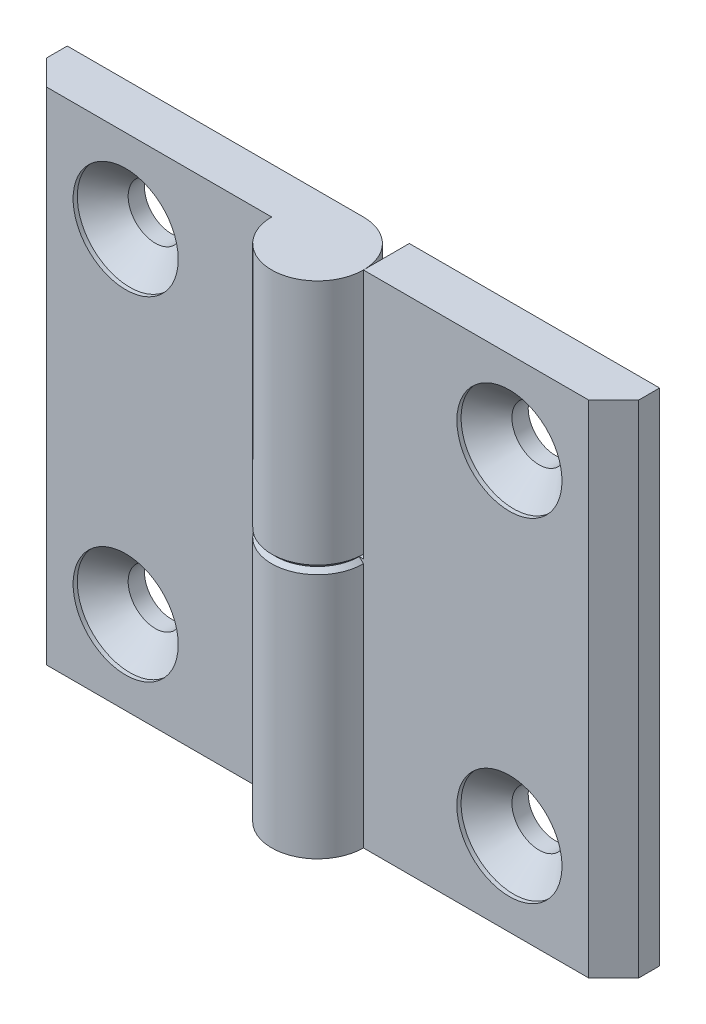
ISO-10303-21;
HEADER;
FILE_DESCRIPTION(('STEP AP214'),'2;1');
FILE_NAME('part.step','',(''),(''),'','','');
FILE_SCHEMA(('AUTOMOTIVE_DESIGN { 1 0 10303 214 1 1 1 1 }'));
ENDSEC;
DATA;
#1=APPLICATION_CONTEXT('core data for automotive mechanical design processes');
#2=APPLICATION_PROTOCOL_DEFINITION('international standard','automotive_design',2000,#1);
#3=PRODUCT_CONTEXT('',#1,'mechanical');
#4=PRODUCT('Part','Part','',(#3));
#5=PRODUCT_RELATED_PRODUCT_CATEGORY('part','',(#4));
#6=PRODUCT_DEFINITION_FORMATION('','',#4);
#7=PRODUCT_DEFINITION_CONTEXT('part definition',#1,'design');
#8=PRODUCT_DEFINITION('design','',#6,#7);
#9=PRODUCT_DEFINITION_SHAPE('','',#8);
#10=(LENGTH_UNIT() NAMED_UNIT(*) SI_UNIT(.MILLI.,.METRE.));
#11=(NAMED_UNIT(*) PLANE_ANGLE_UNIT() SI_UNIT($,.RADIAN.));
#12=(NAMED_UNIT(*) SI_UNIT($,.STERADIAN.) SOLID_ANGLE_UNIT());
#13=UNCERTAINTY_MEASURE_WITH_UNIT(LENGTH_MEASURE(1.E-05),#10,'distance_accuracy_value','');
#14=(GEOMETRIC_REPRESENTATION_CONTEXT(3) GLOBAL_UNCERTAINTY_ASSIGNED_CONTEXT((#13)) GLOBAL_UNIT_ASSIGNED_CONTEXT((#10,
#11,#12)) REPRESENTATION_CONTEXT('',''));
#15=CARTESIAN_POINT('',(0.,0.,0.));
#16=DIRECTION('',(0.,0.,1.));
#17=DIRECTION('',(1.,0.,0.));
#18=AXIS2_PLACEMENT_3D('',#15,#16,#17);
#19=CARTESIAN_POINT('',(0.,-30.,0.));
#20=DIRECTION('',(0.,1.,0.));
#21=DIRECTION('',(0.,0.,-1.));
#22=AXIS2_PLACEMENT_3D('',#19,#20,#21);
#23=CYLINDRICAL_SURFACE('',#22,5.5);
#24=DIRECTION('',(0.,1.,0.));
#25=VECTOR('',#24,1.);
#26=CARTESIAN_POINT('',(5.5,-30.,0.));
#27=LINE('',#26,#25);
#28=CARTESIAN_POINT('',(5.5,-30.,0.));
#29=VERTEX_POINT('',#28);
#30=CARTESIAN_POINT('',(5.5,-0.499999999999997,0.));
#31=VERTEX_POINT('',#30);
#32=EDGE_CURVE('E157',#29,#31,#27,.T.);
#33=ORIENTED_EDGE('',*,*,#32,.T.);
#34=CARTESIAN_POINT('',(0.,-0.499999999999997,0.));
#35=DIRECTION('',(0.,-1.,0.));
#36=DIRECTION('',(0.,0.,1.));
#37=AXIS2_PLACEMENT_3D('',#34,#35,#36);
#38=CIRCLE('',#37,5.5);
#39=CARTESIAN_POINT('',(0.,-0.499999999999997,-5.5));
#40=VERTEX_POINT('',#39);
#41=EDGE_CURVE('E175',#31,#40,#38,.T.);
#42=ORIENTED_EDGE('',*,*,#41,.T.);
#43=DIRECTION('',(0.,1.,0.));
#44=VECTOR('',#43,1.);
#45=CARTESIAN_POINT('',(0.,-30.,-5.5));
#46=LINE('',#45,#44);
#47=CARTESIAN_POINT('',(0.,-30.,-5.5));
#48=VERTEX_POINT('',#47);
#49=EDGE_CURVE('E167',#48,#40,#46,.T.);
#50=ORIENTED_EDGE('',*,*,#49,.F.);
#51=CARTESIAN_POINT('',(0.,-30.,0.));
#52=DIRECTION('',(0.,-1.,0.));
#53=DIRECTION('',(0.,0.,1.));
#54=AXIS2_PLACEMENT_3D('',#51,#52,#53);
#55=CIRCLE('',#54,5.5);
#56=EDGE_CURVE('E156',#29,#48,#55,.T.);
#57=ORIENTED_EDGE('',*,*,#56,.F.);
#58=EDGE_LOOP('',(#33,#42,#50,#57));
#59=FACE_BOUND('',#58,.T.);
#60=ADVANCED_FACE('F46',(#59),#23,.T.);
#61=CARTESIAN_POINT('',(0.,-30.,-5.5));
#62=DIRECTION('',(0.,0.,1.));
#63=DIRECTION('',(-1.,0.,0.));
#64=AXIS2_PLACEMENT_3D('',#61,#62,#63);
#65=PLANE('',#64);
#66=CARTESIAN_POINT('',(23.,-20.,-5.50000000000017));
#67=DIRECTION('',(0.,0.,1.));
#68=DIRECTION('',(-1.,0.,0.));
#69=AXIS2_PLACEMENT_3D('',#66,#67,#68);
#70=CIRCLE('',#69,3.25);
#71=CARTESIAN_POINT('',(19.75,-20.,-5.50000000000015));
#72=VERTEX_POINT('',#71);
#73=EDGE_CURVE('E197',#72,#72,#70,.T.);
#74=ORIENTED_EDGE('',*,*,#73,.T.);
#75=EDGE_LOOP('',(#74));
#76=FACE_BOUND('',#75,.T.);
#77=CARTESIAN_POINT('',(23.,20.,-5.50000000000017));
#78=DIRECTION('',(0.,0.,1.));
#79=DIRECTION('',(-1.,0.,0.));
#80=AXIS2_PLACEMENT_3D('',#77,#78,#79);
#81=CIRCLE('',#80,3.25);
#82=CARTESIAN_POINT('',(19.75,20.,-5.50000000000015));
#83=VERTEX_POINT('',#82);
#84=EDGE_CURVE('E139',#83,#83,#81,.T.);
#85=ORIENTED_EDGE('',*,*,#84,.T.);
#86=EDGE_LOOP('',(#85));
#87=FACE_BOUND('',#86,.T.);
#88=ORIENTED_EDGE('',*,*,#49,.T.);
#89=DIRECTION('',(1.,0.,0.));
#90=VECTOR('',#89,1.);
#91=CARTESIAN_POINT('',(0.,-0.499999999999997,-5.5));
#92=LINE('',#91,#90);
#93=CARTESIAN_POINT('',(5.49999999999996,-0.499999999999997,-5.50000000000004));
#94=VERTEX_POINT('',#93);
#95=EDGE_CURVE('E138',#40,#94,#92,.T.);
#96=ORIENTED_EDGE('',*,*,#95,.T.);
#97=DIRECTION('',(0.,1.,0.));
#98=VECTOR('',#97,1.);
#99=CARTESIAN_POINT('',(5.49999999999996,30.,-5.50000000000004));
#100=LINE('',#99,#98);
#101=CARTESIAN_POINT('',(5.49999999999996,30.,-5.50000000000004));
#102=VERTEX_POINT('',#101);
#103=EDGE_CURVE('E119',#94,#102,#100,.T.);
#104=ORIENTED_EDGE('',*,*,#103,.T.);
#105=DIRECTION('',(1.,0.,0.));
#106=VECTOR('',#105,1.);
#107=CARTESIAN_POINT('',(0.,30.,-5.5));
#108=LINE('',#107,#106);
#109=CARTESIAN_POINT('',(35.5,30.,-5.50000000000026));
#110=VERTEX_POINT('',#109);
#111=EDGE_CURVE('E135',#102,#110,#108,.T.);
#112=ORIENTED_EDGE('',*,*,#111,.T.);
#113=DIRECTION('',(0.,1.,0.));
#114=VECTOR('',#113,1.);
#115=CARTESIAN_POINT('',(35.5,-30.,-5.50000000000026));
#116=LINE('',#115,#114);
#117=CARTESIAN_POINT('',(35.5,-30.,-5.50000000000026));
#118=VERTEX_POINT('',#117);
#119=EDGE_CURVE('E165',#118,#110,#116,.T.);
#120=ORIENTED_EDGE('',*,*,#119,.F.);
#121=DIRECTION('',(1.,0.,0.));
#122=VECTOR('',#121,1.);
#123=CARTESIAN_POINT('',(0.,-30.,-5.5));
#124=LINE('',#123,#122);
#125=EDGE_CURVE('E213',#48,#118,#124,.T.);
#126=ORIENTED_EDGE('',*,*,#125,.F.);
#127=EDGE_LOOP('',(#88,#96,#104,#112,#120,#126));
#128=FACE_BOUND('',#127,.T.);
#129=ADVANCED_FACE('F133',(#76,#87,#128),#65,.F.);
#130=CARTESIAN_POINT('',(35.5,-30.,-5.50000000000026));
#131=DIRECTION('',(-1.,0.,0.));
#132=DIRECTION('',(0.,0.,-1.));
#133=AXIS2_PLACEMENT_3D('',#130,#131,#132);
#134=PLANE('',#133);
#135=DIRECTION('',(0.,0.,1.));
#136=VECTOR('',#135,1.);
#137=CARTESIAN_POINT('',(35.5,30.,-5.50000000000026));
#138=LINE('',#137,#136);
#139=CARTESIAN_POINT('',(35.5,30.,-3.00000000000026));
#140=VERTEX_POINT('',#139);
#141=EDGE_CURVE('E144',#110,#140,#138,.T.);
#142=ORIENTED_EDGE('',*,*,#141,.T.);
#143=DIRECTION('',(0.,1.,0.));
#144=VECTOR('',#143,1.);
#145=CARTESIAN_POINT('',(35.5,-30.,-3.00000000000026));
#146=LINE('',#145,#144);
#147=CARTESIAN_POINT('',(35.5,-30.,-3.00000000000026));
#148=VERTEX_POINT('',#147);
#149=EDGE_CURVE('E162',#148,#140,#146,.T.);
#150=ORIENTED_EDGE('',*,*,#149,.F.);
#151=DIRECTION('',(0.,0.,1.));
#152=VECTOR('',#151,1.);
#153=CARTESIAN_POINT('',(35.5,-30.,-5.50000000000026));
#154=LINE('',#153,#152);
#155=EDGE_CURVE('E215',#118,#148,#154,.T.);
#156=ORIENTED_EDGE('',*,*,#155,.F.);
#157=ORIENTED_EDGE('',*,*,#119,.T.);
#158=EDGE_LOOP('',(#142,#150,#156,#157));
#159=FACE_BOUND('',#158,.T.);
#160=ADVANCED_FACE('F229',(#159),#134,.F.);
#161=CARTESIAN_POINT('',(35.5,-30.,-3.00000000000026));
#162=DIRECTION('',(-0.707106781186549,0.,-0.707106781186546));
#163=DIRECTION('',(0.707106781186546,0.,-0.707106781186549));
#164=AXIS2_PLACEMENT_3D('',#161,#162,#163);
#165=PLANE('',#164);
#166=DIRECTION('',(-0.707106781186545,0.,0.707106781186549));
#167=VECTOR('',#166,1.);
#168=CARTESIAN_POINT('',(35.5,30.,-3.00000000000026));
#169=LINE('',#168,#167);
#170=CARTESIAN_POINT('',(32.5,30.,-2.42866695413719E-13));
#171=VERTEX_POINT('',#170);
#172=EDGE_CURVE('E146',#140,#171,#169,.T.);
#173=ORIENTED_EDGE('',*,*,#172,.T.);
#174=DIRECTION('',(0.,1.,0.));
#175=VECTOR('',#174,1.);
#176=CARTESIAN_POINT('',(32.5,-30.,-2.42866695413719E-13));
#177=LINE('',#176,#175);
#178=CARTESIAN_POINT('',(32.5,-30.,-2.42866695413719E-13));
#179=VERTEX_POINT('',#178);
#180=EDGE_CURVE('E159',#179,#171,#177,.T.);
#181=ORIENTED_EDGE('',*,*,#180,.F.);
#182=DIRECTION('',(-0.707106781186545,0.,0.707106781186549));
#183=VECTOR('',#182,1.);
#184=CARTESIAN_POINT('',(35.5,-30.,-3.00000000000026));
#185=LINE('',#184,#183);
#186=EDGE_CURVE('E216',#148,#179,#185,.T.);
#187=ORIENTED_EDGE('',*,*,#186,.F.);
#188=ORIENTED_EDGE('',*,*,#149,.T.);
#189=EDGE_LOOP('',(#173,#181,#187,#188));
#190=FACE_BOUND('',#189,.T.);
#191=ADVANCED_FACE('F231',(#190),#165,.F.);
#192=CARTESIAN_POINT('',(32.5,-30.,-2.42866695413719E-13));
#193=DIRECTION('',(0.,0.,-1.));
#194=DIRECTION('',(1.,0.,0.));
#195=AXIS2_PLACEMENT_3D('',#192,#193,#194);
#196=PLANE('',#195);
#197=CARTESIAN_POINT('',(23.,-20.,-1.72091732573437E-13));
#198=DIRECTION('',(0.,0.,1.));
#199=DIRECTION('',(-1.,0.,0.));
#200=AXIS2_PLACEMENT_3D('',#197,#198,#199);
#201=CIRCLE('',#200,6.3);
#202=CARTESIAN_POINT('',(16.7,-20.,-1.25012957770162E-13));
#203=VERTEX_POINT('',#202);
#204=EDGE_CURVE('E185',#203,#203,#201,.T.);
#205=ORIENTED_EDGE('',*,*,#204,.F.);
#206=EDGE_LOOP('',(#205));
#207=FACE_BOUND('',#206,.T.);
#208=CARTESIAN_POINT('',(23.,20.,-1.72091732573437E-13));
#209=DIRECTION('',(0.,0.,1.));
#210=DIRECTION('',(-1.,0.,0.));
#211=AXIS2_PLACEMENT_3D('',#208,#209,#210);
#212=CIRCLE('',#211,6.3);
#213=CARTESIAN_POINT('',(16.7,20.,-1.25012957770162E-13));
#214=VERTEX_POINT('',#213);
#215=EDGE_CURVE('E200',#214,#214,#212,.T.);
#216=ORIENTED_EDGE('',*,*,#215,.F.);
#217=EDGE_LOOP('',(#216));
#218=FACE_BOUND('',#217,.T.);
#219=DIRECTION('',(-1.,0.,0.));
#220=VECTOR('',#219,1.);
#221=CARTESIAN_POINT('',(32.5,30.,-2.42866695413719E-13));
#222=LINE('',#221,#220);
#223=CARTESIAN_POINT('',(5.5,30.,0.));
#224=VERTEX_POINT('',#223);
#225=EDGE_CURVE('E154',#171,#224,#222,.T.);
#226=ORIENTED_EDGE('',*,*,#225,.T.);
#227=DIRECTION('',(0.,-1.,0.));
#228=VECTOR('',#227,1.);
#229=CARTESIAN_POINT('',(5.5,-30.,0.));
#230=LINE('',#229,#228);
#231=CARTESIAN_POINT('',(5.5,0.,0.));
#232=VERTEX_POINT('',#231);
#233=EDGE_CURVE('E123',#224,#232,#230,.T.);
#234=ORIENTED_EDGE('',*,*,#233,.T.);
#235=DIRECTION('',(1.,0.,0.));
#236=VECTOR('',#235,1.);
#237=CARTESIAN_POINT('',(-5.5,0.,0.));
#238=LINE('',#237,#236);
#239=CARTESIAN_POINT('',(4.99999999999999,0.,0.));
#240=VERTEX_POINT('',#239);
#241=EDGE_CURVE('E170',#240,#232,#238,.T.);
#242=ORIENTED_EDGE('',*,*,#241,.F.);
#243=DIRECTION('',(0.707106781186555,-0.70710678118654,0.));
#244=VECTOR('',#243,1.);
#245=CARTESIAN_POINT('',(0.,4.99999999999989,0.));
#246=LINE('',#245,#244);
#247=EDGE_CURVE('E12',#240,#31,#246,.T.);
#248=ORIENTED_EDGE('',*,*,#247,.T.);
#249=ORIENTED_EDGE('',*,*,#32,.F.);
#250=DIRECTION('',(-1.,0.,0.));
#251=VECTOR('',#250,1.);
#252=CARTESIAN_POINT('',(32.5,-30.,-2.42866695413719E-13));
#253=LINE('',#252,#251);
#254=EDGE_CURVE('E150',#179,#29,#253,.T.);
#255=ORIENTED_EDGE('',*,*,#254,.F.);
#256=ORIENTED_EDGE('',*,*,#180,.T.);
#257=EDGE_LOOP('',(#226,#234,#242,#248,#249,#255,#256));
#258=FACE_BOUND('',#257,.T.);
#259=ADVANCED_FACE('F224',(#207,#218,#258),#196,.F.);
#260=CARTESIAN_POINT('',(0.,-30.,0.));
#261=DIRECTION('',(0.,-1.,0.));
#262=DIRECTION('',(0.,0.,1.));
#263=AXIS2_PLACEMENT_3D('',#260,#261,#262);
#264=PLANE('',#263);
#265=ORIENTED_EDGE('',*,*,#56,.T.);
#266=ORIENTED_EDGE('',*,*,#125,.T.);
#267=ORIENTED_EDGE('',*,*,#155,.T.);
#268=ORIENTED_EDGE('',*,*,#186,.T.);
#269=ORIENTED_EDGE('',*,*,#254,.T.);
#270=EDGE_LOOP('',(#265,#266,#267,#268,#269));
#271=FACE_BOUND('',#270,.T.);
#272=ADVANCED_FACE('F221',(#271),#264,.T.);
#273=CARTESIAN_POINT('',(0.,30.,0.));
#274=DIRECTION('',(0.,-1.,0.));
#275=DIRECTION('',(0.,0.,1.));
#276=AXIS2_PLACEMENT_3D('',#273,#274,#275);
#277=PLANE('',#276);
#278=ORIENTED_EDGE('',*,*,#111,.F.);
#279=DIRECTION('',(0.,0.,1.));
#280=VECTOR('',#279,1.);
#281=CARTESIAN_POINT('',(5.49999999999996,30.,-5.50000000000004));
#282=LINE('',#281,#280);
#283=EDGE_CURVE('E116',#102,#224,#282,.T.);
#284=ORIENTED_EDGE('',*,*,#283,.T.);
#285=ORIENTED_EDGE('',*,*,#225,.F.);
#286=ORIENTED_EDGE('',*,*,#172,.F.);
#287=ORIENTED_EDGE('',*,*,#141,.F.);
#288=EDGE_LOOP('',(#278,#284,#285,#286,#287));
#289=FACE_BOUND('',#288,.T.);
#290=ADVANCED_FACE('F142',(#289),#277,.F.);
#291=CARTESIAN_POINT('',(-5.50000000000004,0.,-5.49999999999996));
#292=DIRECTION('',(0.,-1.,0.));
#293=DIRECTION('',(0.,0.,1.));
#294=AXIS2_PLACEMENT_3D('',#291,#292,#293);
#295=PLANE('',#294);
#296=DIRECTION('',(0.,0.,1.));
#297=VECTOR('',#296,1.);
#298=CARTESIAN_POINT('',(5.49999999999996,0.,-5.50000000000004));
#299=LINE('',#298,#297);
#300=CARTESIAN_POINT('',(5.49999999999996,0.,-5.00000000000003));
#301=VERTEX_POINT('',#300);
#302=EDGE_CURVE('E128',#301,#232,#299,.T.);
#303=ORIENTED_EDGE('',*,*,#302,.F.);
#304=DIRECTION('',(-1.,0.,0.));
#305=VECTOR('',#304,1.);
#306=CARTESIAN_POINT('',(-5.50000000000004,0.,-4.99999999999995));
#307=LINE('',#306,#305);
#308=CARTESIAN_POINT('',(0.,0.,-4.99999999999999));
#309=VERTEX_POINT('',#308);
#310=EDGE_CURVE('E69',#301,#309,#307,.T.);
#311=ORIENTED_EDGE('',*,*,#310,.T.);
#312=CARTESIAN_POINT('',(0.,0.,0.));
#313=DIRECTION('',(0.,-1.,0.));
#314=DIRECTION('',(0.,0.,1.));
#315=AXIS2_PLACEMENT_3D('',#312,#313,#314);
#316=CIRCLE('',#315,4.99999999999999);
#317=EDGE_CURVE('E172',#309,#240,#316,.F.);
#318=ORIENTED_EDGE('',*,*,#317,.T.);
#319=ORIENTED_EDGE('',*,*,#241,.T.);
#320=EDGE_LOOP('',(#303,#311,#318,#319));
#321=FACE_BOUND('',#320,.T.);
#322=ADVANCED_FACE('F178',(#321),#295,.F.);
#323=CARTESIAN_POINT('',(5.49999999999996,30.,-5.50000000000004));
#324=DIRECTION('',(1.,0.,0.));
#325=DIRECTION('',(0.,0.,1.));
#326=AXIS2_PLACEMENT_3D('',#323,#324,#325);
#327=PLANE('',#326);
#328=ORIENTED_EDGE('',*,*,#283,.F.);
#329=ORIENTED_EDGE('',*,*,#103,.F.);
#330=DIRECTION('',(0.,-0.70710678118654,-0.707106781186555));
#331=VECTOR('',#330,1.);
#332=CARTESIAN_POINT('',(5.50000000000007,14.7499999999997,9.74999999999996));
#333=LINE('',#332,#331);
#334=EDGE_CURVE('E56',#94,#301,#333,.F.);
#335=ORIENTED_EDGE('',*,*,#334,.T.);
#336=ORIENTED_EDGE('',*,*,#302,.T.);
#337=ORIENTED_EDGE('',*,*,#233,.F.);
#338=EDGE_LOOP('',(#328,#329,#335,#336,#337));
#339=FACE_BOUND('',#338,.T.);
#340=ADVANCED_FACE('F118',(#339),#327,.F.);
#341=CARTESIAN_POINT('',(23.,20.,-1.7187489213894E-13));
#342=DIRECTION('',(0.,0.,1.));
#343=DIRECTION('',(-1.,0.,0.));
#344=AXIS2_PLACEMENT_3D('',#341,#342,#343);
#345=CYLINDRICAL_SURFACE('',#344,3.25);
#346=ORIENTED_EDGE('',*,*,#84,.F.);
#347=EDGE_LOOP('',(#346));
#348=FACE_BOUND('',#347,.T.);
#349=CARTESIAN_POINT('',(23.,20.,-3.55000000000017));
#350=DIRECTION('',(0.,0.,1.));
#351=DIRECTION('',(-1.,0.,0.));
#352=AXIS2_PLACEMENT_3D('',#349,#350,#351);
#353=CIRCLE('',#352,3.25);
#354=CARTESIAN_POINT('',(19.75,20.,-3.55000000000015));
#355=VERTEX_POINT('',#354);
#356=EDGE_CURVE('E206',#355,#355,#353,.T.);
#357=ORIENTED_EDGE('',*,*,#356,.T.);
#358=EDGE_LOOP('',(#357));
#359=FACE_BOUND('',#358,.T.);
#360=ADVANCED_FACE('F269',(#348,#359),#345,.F.);
#361=CARTESIAN_POINT('',(23.,20.,-0.500000000000172));
#362=DIRECTION('',(0.,0.,1.));
#363=DIRECTION('',(-1.,0.,0.));
#364=AXIS2_PLACEMENT_3D('',#361,#362,#363);
#365=CONICAL_SURFACE('',#364,6.3,0.785398163397449);
#366=ORIENTED_EDGE('',*,*,#356,.F.);
#367=EDGE_LOOP('',(#366));
#368=FACE_BOUND('',#367,.T.);
#369=CARTESIAN_POINT('',(23.,20.,-0.500000000000172));
#370=DIRECTION('',(0.,0.,1.));
#371=DIRECTION('',(-1.,0.,0.));
#372=AXIS2_PLACEMENT_3D('',#369,#370,#371);
#373=CIRCLE('',#372,6.3);
#374=CARTESIAN_POINT('',(16.7,20.,-0.500000000000125));
#375=VERTEX_POINT('',#374);
#376=EDGE_CURVE('E203',#375,#375,#373,.T.);
#377=ORIENTED_EDGE('',*,*,#376,.T.);
#378=EDGE_LOOP('',(#377));
#379=FACE_BOUND('',#378,.T.);
#380=ADVANCED_FACE('F272',(#368,#379),#365,.F.);
#381=CARTESIAN_POINT('',(23.,20.,-1.7187489213894E-13));
#382=DIRECTION('',(0.,0.,1.));
#383=DIRECTION('',(-1.,0.,0.));
#384=AXIS2_PLACEMENT_3D('',#381,#382,#383);
#385=CYLINDRICAL_SURFACE('',#384,6.3);
#386=ORIENTED_EDGE('',*,*,#376,.F.);
#387=EDGE_LOOP('',(#386));
#388=FACE_BOUND('',#387,.T.);
#389=ORIENTED_EDGE('',*,*,#215,.T.);
#390=EDGE_LOOP('',(#389));
#391=FACE_BOUND('',#390,.T.);
#392=ADVANCED_FACE('F276',(#388,#391),#385,.F.);
#393=CARTESIAN_POINT('',(23.,-20.,-1.7187489213894E-13));
#394=DIRECTION('',(0.,0.,1.));
#395=DIRECTION('',(-1.,0.,0.));
#396=AXIS2_PLACEMENT_3D('',#393,#394,#395);
#397=CYLINDRICAL_SURFACE('',#396,3.25);
#398=ORIENTED_EDGE('',*,*,#73,.F.);
#399=EDGE_LOOP('',(#398));
#400=FACE_BOUND('',#399,.T.);
#401=CARTESIAN_POINT('',(23.,-20.,-3.55000000000017));
#402=DIRECTION('',(0.,0.,1.));
#403=DIRECTION('',(-1.,0.,0.));
#404=AXIS2_PLACEMENT_3D('',#401,#402,#403);
#405=CIRCLE('',#404,3.25);
#406=CARTESIAN_POINT('',(19.75,-20.,-3.55000000000015));
#407=VERTEX_POINT('',#406);
#408=EDGE_CURVE('E192',#407,#407,#405,.T.);
#409=ORIENTED_EDGE('',*,*,#408,.T.);
#410=EDGE_LOOP('',(#409));
#411=FACE_BOUND('',#410,.T.);
#412=ADVANCED_FACE('F280',(#400,#411),#397,.F.);
#413=CARTESIAN_POINT('',(23.,-20.,-0.500000000000172));
#414=DIRECTION('',(0.,0.,1.));
#415=DIRECTION('',(-1.,0.,0.));
#416=AXIS2_PLACEMENT_3D('',#413,#414,#415);
#417=CONICAL_SURFACE('',#416,6.3,0.785398163397449);
#418=ORIENTED_EDGE('',*,*,#408,.F.);
#419=EDGE_LOOP('',(#418));
#420=FACE_BOUND('',#419,.T.);
#421=CARTESIAN_POINT('',(23.,-20.,-0.500000000000172));
#422=DIRECTION('',(0.,0.,1.));
#423=DIRECTION('',(-1.,0.,0.));
#424=AXIS2_PLACEMENT_3D('',#421,#422,#423);
#425=CIRCLE('',#424,6.3);
#426=CARTESIAN_POINT('',(16.7,-20.,-0.500000000000125));
#427=VERTEX_POINT('',#426);
#428=EDGE_CURVE('E187',#427,#427,#425,.T.);
#429=ORIENTED_EDGE('',*,*,#428,.T.);
#430=EDGE_LOOP('',(#429));
#431=FACE_BOUND('',#430,.T.);
#432=ADVANCED_FACE('F238',(#420,#431),#417,.F.);
#433=CARTESIAN_POINT('',(23.,-20.,-1.7187489213894E-13));
#434=DIRECTION('',(0.,0.,1.));
#435=DIRECTION('',(-1.,0.,0.));
#436=AXIS2_PLACEMENT_3D('',#433,#434,#435);
#437=CYLINDRICAL_SURFACE('',#436,6.3);
#438=ORIENTED_EDGE('',*,*,#428,.F.);
#439=EDGE_LOOP('',(#438));
#440=FACE_BOUND('',#439,.T.);
#441=ORIENTED_EDGE('',*,*,#204,.T.);
#442=EDGE_LOOP('',(#441));
#443=FACE_BOUND('',#442,.T.);
#444=ADVANCED_FACE('F233',(#440,#443),#437,.F.);
#445=CARTESIAN_POINT('',(0.,-0.499999999999997,0.));
#446=DIRECTION('',(0.,-1.,0.));
#447=DIRECTION('',(0.,0.,1.));
#448=AXIS2_PLACEMENT_3D('',#445,#446,#447);
#449=CONICAL_SURFACE('',#448,5.5,0.785398163397459);
#450=ORIENTED_EDGE('',*,*,#247,.F.);
#451=ORIENTED_EDGE('',*,*,#317,.F.);
#452=DIRECTION('',(0.,0.70710678118654,0.707106781186555));
#453=VECTOR('',#452,1.);
#454=CARTESIAN_POINT('',(0.,-0.499999999999997,-5.5));
#455=LINE('',#454,#453);
#456=EDGE_CURVE('E51',#40,#309,#455,.T.);
#457=ORIENTED_EDGE('',*,*,#456,.F.);
#458=ORIENTED_EDGE('',*,*,#41,.F.);
#459=EDGE_LOOP('',(#450,#451,#457,#458));
#460=FACE_BOUND('',#459,.T.);
#461=ADVANCED_FACE('F49',(#460),#449,.T.);
#462=CARTESIAN_POINT('',(0.,-0.499999999999997,-5.5));
#463=DIRECTION('',(0.,-0.707106781186555,0.70710678118654));
#464=DIRECTION('',(1.,0.,0.));
#465=AXIS2_PLACEMENT_3D('',#462,#463,#464);
#466=PLANE('',#465);
#467=ORIENTED_EDGE('',*,*,#456,.T.);
#468=ORIENTED_EDGE('',*,*,#310,.F.);
#469=ORIENTED_EDGE('',*,*,#334,.F.);
#470=ORIENTED_EDGE('',*,*,#95,.F.);
#471=EDGE_LOOP('',(#467,#468,#469,#470));
#472=FACE_BOUND('',#471,.T.);
#473=ADVANCED_FACE('F181',(#472),#466,.F.);
#474=CLOSED_SHELL('',(#60,#129,#160,#191,#259,#272,#290,#322,#340,#360,#380,#392,#412,#432,#444,
#461,#473));
#475=MANIFOLD_SOLID_BREP('B2',#474);
#476=CARTESIAN_POINT('',(0.,30.,0.));
#477=DIRECTION('',(0.,-1.,0.));
#478=DIRECTION('',(0.,0.,-1.));
#479=AXIS2_PLACEMENT_3D('',#476,#477,#478);
#480=CYLINDRICAL_SURFACE('',#479,5.5);
#481=DIRECTION('',(0.,-1.,0.));
#482=VECTOR('',#481,1.);
#483=CARTESIAN_POINT('',(-5.5,30.,0.));
#484=LINE('',#483,#482);
#485=CARTESIAN_POINT('',(-5.5,30.,0.));
#486=VERTEX_POINT('',#485);
#487=CARTESIAN_POINT('',(-5.5,0.499999999999997,0.));
#488=VERTEX_POINT('',#487);
#489=EDGE_CURVE('E512',#486,#488,#484,.T.);
#490=ORIENTED_EDGE('',*,*,#489,.T.);
#491=CARTESIAN_POINT('',(0.,0.499999999999997,0.));
#492=DIRECTION('',(0.,1.,0.));
#493=DIRECTION('',(0.,0.,1.));
#494=AXIS2_PLACEMENT_3D('',#491,#492,#493);
#495=CIRCLE('',#494,5.5);
#496=CARTESIAN_POINT('',(0.,0.499999999999997,-5.5));
#497=VERTEX_POINT('',#496);
#498=EDGE_CURVE('E530',#488,#497,#495,.T.);
#499=ORIENTED_EDGE('',*,*,#498,.T.);
#500=DIRECTION('',(0.,-1.,0.));
#501=VECTOR('',#500,1.);
#502=CARTESIAN_POINT('',(0.,30.,-5.5));
#503=LINE('',#502,#501);
#504=CARTESIAN_POINT('',(0.,30.,-5.5));
#505=VERTEX_POINT('',#504);
#506=EDGE_CURVE('E522',#505,#497,#503,.T.);
#507=ORIENTED_EDGE('',*,*,#506,.F.);
#508=CARTESIAN_POINT('',(0.,30.,0.));
#509=DIRECTION('',(0.,1.,0.));
#510=DIRECTION('',(0.,0.,1.));
#511=AXIS2_PLACEMENT_3D('',#508,#509,#510);
#512=CIRCLE('',#511,5.5);
#513=EDGE_CURVE('E511',#486,#505,#512,.T.);
#514=ORIENTED_EDGE('',*,*,#513,.F.);
#515=EDGE_LOOP('',(#490,#499,#507,#514));
#516=FACE_BOUND('',#515,.T.);
#517=ADVANCED_FACE('F401',(#516),#480,.T.);
#518=CARTESIAN_POINT('',(0.,30.,-5.5));
#519=DIRECTION('',(0.,0.,1.));
#520=DIRECTION('',(1.,0.,0.));
#521=AXIS2_PLACEMENT_3D('',#518,#519,#520);
#522=PLANE('',#521);
#523=CARTESIAN_POINT('',(-23.,20.,-5.5));
#524=DIRECTION('',(0.,0.,1.));
#525=DIRECTION('',(1.,0.,0.));
#526=AXIS2_PLACEMENT_3D('',#523,#524,#525);
#527=CIRCLE('',#526,3.25);
#528=CARTESIAN_POINT('',(-19.75,20.,-5.5));
#529=VERTEX_POINT('',#528);
#530=EDGE_CURVE('E552',#529,#529,#527,.T.);
#531=ORIENTED_EDGE('',*,*,#530,.T.);
#532=EDGE_LOOP('',(#531));
#533=FACE_BOUND('',#532,.T.);
#534=CARTESIAN_POINT('',(-23.,-20.,-5.5));
#535=DIRECTION('',(0.,0.,1.));
#536=DIRECTION('',(1.,0.,0.));
#537=AXIS2_PLACEMENT_3D('',#534,#535,#536);
#538=CIRCLE('',#537,3.25);
#539=CARTESIAN_POINT('',(-19.75,-20.,-5.5));
#540=VERTEX_POINT('',#539);
#541=EDGE_CURVE('E494',#540,#540,#538,.T.);
#542=ORIENTED_EDGE('',*,*,#541,.T.);
#543=EDGE_LOOP('',(#542));
#544=FACE_BOUND('',#543,.T.);
#545=ORIENTED_EDGE('',*,*,#506,.T.);
#546=DIRECTION('',(-1.,0.,0.));
#547=VECTOR('',#546,1.);
#548=CARTESIAN_POINT('',(0.,0.499999999999997,-5.5));
#549=LINE('',#548,#547);
#550=CARTESIAN_POINT('',(-5.5,0.499999999999997,-5.5));
#551=VERTEX_POINT('',#550);
#552=EDGE_CURVE('E493',#497,#551,#549,.T.);
#553=ORIENTED_EDGE('',*,*,#552,.T.);
#554=DIRECTION('',(0.,-1.,0.));
#555=VECTOR('',#554,1.);
#556=CARTESIAN_POINT('',(-5.5,-30.,-5.5));
#557=LINE('',#556,#555);
#558=CARTESIAN_POINT('',(-5.5,-30.,-5.5));
#559=VERTEX_POINT('',#558);
#560=EDGE_CURVE('E474',#551,#559,#557,.T.);
#561=ORIENTED_EDGE('',*,*,#560,.T.);
#562=DIRECTION('',(-1.,0.,0.));
#563=VECTOR('',#562,1.);
#564=CARTESIAN_POINT('',(0.,-30.,-5.5));
#565=LINE('',#564,#563);
#566=CARTESIAN_POINT('',(-35.5,-30.,-5.5));
#567=VERTEX_POINT('',#566);
#568=EDGE_CURVE('E490',#559,#567,#565,.T.);
#569=ORIENTED_EDGE('',*,*,#568,.T.);
#570=DIRECTION('',(0.,-1.,0.));
#571=VECTOR('',#570,1.);
#572=CARTESIAN_POINT('',(-35.5,30.,-5.5));
#573=LINE('',#572,#571);
#574=CARTESIAN_POINT('',(-35.5,30.,-5.5));
#575=VERTEX_POINT('',#574);
#576=EDGE_CURVE('E520',#575,#567,#573,.T.);
#577=ORIENTED_EDGE('',*,*,#576,.F.);
#578=DIRECTION('',(-1.,0.,0.));
#579=VECTOR('',#578,1.);
#580=CARTESIAN_POINT('',(0.,30.,-5.5));
#581=LINE('',#580,#579);
#582=EDGE_CURVE('E568',#505,#575,#581,.T.);
#583=ORIENTED_EDGE('',*,*,#582,.F.);
#584=EDGE_LOOP('',(#545,#553,#561,#569,#577,#583));
#585=FACE_BOUND('',#584,.T.);
#586=ADVANCED_FACE('F488',(#533,#544,#585),#522,.F.);
#587=CARTESIAN_POINT('',(-35.5,30.,-5.5));
#588=DIRECTION('',(1.,0.,0.));
#589=DIRECTION('',(0.,0.,-1.));
#590=AXIS2_PLACEMENT_3D('',#587,#588,#589);
#591=PLANE('',#590);
#592=DIRECTION('',(0.,0.,1.));
#593=VECTOR('',#592,1.);
#594=CARTESIAN_POINT('',(-35.5,-30.,-5.5));
#595=LINE('',#594,#593);
#596=CARTESIAN_POINT('',(-35.5,-30.,-3.));
#597=VERTEX_POINT('',#596);
#598=EDGE_CURVE('E499',#567,#597,#595,.T.);
#599=ORIENTED_EDGE('',*,*,#598,.T.);
#600=DIRECTION('',(0.,-1.,0.));
#601=VECTOR('',#600,1.);
#602=CARTESIAN_POINT('',(-35.5,30.,-3.));
#603=LINE('',#602,#601);
#604=CARTESIAN_POINT('',(-35.5,30.,-3.));
#605=VERTEX_POINT('',#604);
#606=EDGE_CURVE('E517',#605,#597,#603,.T.);
#607=ORIENTED_EDGE('',*,*,#606,.F.);
#608=DIRECTION('',(0.,0.,1.));
#609=VECTOR('',#608,1.);
#610=CARTESIAN_POINT('',(-35.5,30.,-5.5));
#611=LINE('',#610,#609);
#612=EDGE_CURVE('E570',#575,#605,#611,.T.);
#613=ORIENTED_EDGE('',*,*,#612,.F.);
#614=ORIENTED_EDGE('',*,*,#576,.T.);
#615=EDGE_LOOP('',(#599,#607,#613,#614));
#616=FACE_BOUND('',#615,.T.);
#617=ADVANCED_FACE('F584',(#616),#591,.F.);
#618=CARTESIAN_POINT('',(-35.5,30.,-3.));
#619=DIRECTION('',(0.707106781186544,0.,-0.707106781186551));
#620=DIRECTION('',(-0.707106781186551,0.,-0.707106781186544));
#621=AXIS2_PLACEMENT_3D('',#618,#619,#620);
#622=PLANE('',#621);
#623=DIRECTION('',(0.707106781186551,0.,0.707106781186544));
#624=VECTOR('',#623,1.);
#625=CARTESIAN_POINT('',(-35.5,-30.,-3.));
#626=LINE('',#625,#624);
#627=CARTESIAN_POINT('',(-32.5,-30.,0.));
#628=VERTEX_POINT('',#627);
#629=EDGE_CURVE('E501',#597,#628,#626,.T.);
#630=ORIENTED_EDGE('',*,*,#629,.T.);
#631=DIRECTION('',(0.,-1.,0.));
#632=VECTOR('',#631,1.);
#633=CARTESIAN_POINT('',(-32.5,30.,0.));
#634=LINE('',#633,#632);
#635=CARTESIAN_POINT('',(-32.5,30.,0.));
#636=VERTEX_POINT('',#635);
#637=EDGE_CURVE('E514',#636,#628,#634,.T.);
#638=ORIENTED_EDGE('',*,*,#637,.F.);
#639=DIRECTION('',(0.707106781186551,0.,0.707106781186544));
#640=VECTOR('',#639,1.);
#641=CARTESIAN_POINT('',(-35.5,30.,-3.));
#642=LINE('',#641,#640);
#643=EDGE_CURVE('E571',#605,#636,#642,.T.);
#644=ORIENTED_EDGE('',*,*,#643,.F.);
#645=ORIENTED_EDGE('',*,*,#606,.T.);
#646=EDGE_LOOP('',(#630,#638,#644,#645));
#647=FACE_BOUND('',#646,.T.);
#648=ADVANCED_FACE('F586',(#647),#622,.F.);
#649=CARTESIAN_POINT('',(-32.5,30.,0.));
#650=DIRECTION('',(0.,0.,-1.));
#651=DIRECTION('',(-1.,0.,0.));
#652=AXIS2_PLACEMENT_3D('',#649,#650,#651);
#653=PLANE('',#652);
#654=CARTESIAN_POINT('',(-23.,20.,0.));
#655=DIRECTION('',(0.,0.,1.));
#656=DIRECTION('',(1.,0.,0.));
#657=AXIS2_PLACEMENT_3D('',#654,#655,#656);
#658=CIRCLE('',#657,6.3);
#659=CARTESIAN_POINT('',(-16.7,20.,0.));
#660=VERTEX_POINT('',#659);
#661=EDGE_CURVE('E540',#660,#660,#658,.T.);
#662=ORIENTED_EDGE('',*,*,#661,.F.);
#663=EDGE_LOOP('',(#662));
#664=FACE_BOUND('',#663,.T.);
#665=CARTESIAN_POINT('',(-23.,-20.,0.));
#666=DIRECTION('',(0.,0.,1.));
#667=DIRECTION('',(1.,0.,0.));
#668=AXIS2_PLACEMENT_3D('',#665,#666,#667);
#669=CIRCLE('',#668,6.3);
#670=CARTESIAN_POINT('',(-16.7,-20.,0.));
#671=VERTEX_POINT('',#670);
#672=EDGE_CURVE('E555',#671,#671,#669,.T.);
#673=ORIENTED_EDGE('',*,*,#672,.F.);
#674=EDGE_LOOP('',(#673));
#675=FACE_BOUND('',#674,.T.);
#676=DIRECTION('',(1.,0.,0.));
#677=VECTOR('',#676,1.);
#678=CARTESIAN_POINT('',(-32.5,-30.,0.));
#679=LINE('',#678,#677);
#680=CARTESIAN_POINT('',(-5.5,-30.,0.));
#681=VERTEX_POINT('',#680);
#682=EDGE_CURVE('E509',#628,#681,#679,.T.);
#683=ORIENTED_EDGE('',*,*,#682,.T.);
#684=DIRECTION('',(0.,1.,0.));
#685=VECTOR('',#684,1.);
#686=CARTESIAN_POINT('',(-5.5,30.,0.));
#687=LINE('',#686,#685);
#688=CARTESIAN_POINT('',(-5.5,0.,0.));
#689=VERTEX_POINT('',#688);
#690=EDGE_CURVE('E478',#681,#689,#687,.T.);
#691=ORIENTED_EDGE('',*,*,#690,.T.);
#692=DIRECTION('',(-1.,0.,0.));
#693=VECTOR('',#692,1.);
#694=CARTESIAN_POINT('',(5.5,0.,0.));
#695=LINE('',#694,#693);
#696=CARTESIAN_POINT('',(-4.99999999999999,0.,0.));
#697=VERTEX_POINT('',#696);
#698=EDGE_CURVE('E525',#697,#689,#695,.T.);
#699=ORIENTED_EDGE('',*,*,#698,.F.);
#700=DIRECTION('',(-0.707106781186555,0.70710678118654,0.));
#701=VECTOR('',#700,1.);
#702=CARTESIAN_POINT('',(0.,-4.99999999999989,0.));
#703=LINE('',#702,#701);
#704=EDGE_CURVE('E44',#697,#488,#703,.T.);
#705=ORIENTED_EDGE('',*,*,#704,.T.);
#706=ORIENTED_EDGE('',*,*,#489,.F.);
#707=DIRECTION('',(1.,0.,0.));
#708=VECTOR('',#707,1.);
#709=CARTESIAN_POINT('',(-32.5,30.,0.));
#710=LINE('',#709,#708);
#711=EDGE_CURVE('E505',#636,#486,#710,.T.);
#712=ORIENTED_EDGE('',*,*,#711,.F.);
#713=ORIENTED_EDGE('',*,*,#637,.T.);
#714=EDGE_LOOP('',(#683,#691,#699,#705,#706,#712,#713));
#715=FACE_BOUND('',#714,.T.);
#716=ADVANCED_FACE('F579',(#664,#675,#715),#653,.F.);
#717=CARTESIAN_POINT('',(0.,30.,0.));
#718=DIRECTION('',(0.,1.,0.));
#719=DIRECTION('',(0.,0.,1.));
#720=AXIS2_PLACEMENT_3D('',#717,#718,#719);
#721=PLANE('',#720);
#722=ORIENTED_EDGE('',*,*,#513,.T.);
#723=ORIENTED_EDGE('',*,*,#582,.T.);
#724=ORIENTED_EDGE('',*,*,#612,.T.);
#725=ORIENTED_EDGE('',*,*,#643,.T.);
#726=ORIENTED_EDGE('',*,*,#711,.T.);
#727=EDGE_LOOP('',(#722,#723,#724,#725,#726));
#728=FACE_BOUND('',#727,.T.);
#729=ADVANCED_FACE('F576',(#728),#721,.T.);
#730=CARTESIAN_POINT('',(0.,-30.,0.));
#731=DIRECTION('',(0.,1.,0.));
#732=DIRECTION('',(0.,0.,1.));
#733=AXIS2_PLACEMENT_3D('',#730,#731,#732);
#734=PLANE('',#733);
#735=ORIENTED_EDGE('',*,*,#568,.F.);
#736=DIRECTION('',(0.,0.,1.));
#737=VECTOR('',#736,1.);
#738=CARTESIAN_POINT('',(-5.5,-30.,-5.5));
#739=LINE('',#738,#737);
#740=EDGE_CURVE('E471',#559,#681,#739,.T.);
#741=ORIENTED_EDGE('',*,*,#740,.T.);
#742=ORIENTED_EDGE('',*,*,#682,.F.);
#743=ORIENTED_EDGE('',*,*,#629,.F.);
#744=ORIENTED_EDGE('',*,*,#598,.F.);
#745=EDGE_LOOP('',(#735,#741,#742,#743,#744));
#746=FACE_BOUND('',#745,.T.);
#747=ADVANCED_FACE('F497',(#746),#734,.F.);
#748=CARTESIAN_POINT('',(5.5,0.,-5.5));
#749=DIRECTION('',(0.,1.,0.));
#750=DIRECTION('',(0.,0.,1.));
#751=AXIS2_PLACEMENT_3D('',#748,#749,#750);
#752=PLANE('',#751);
#753=DIRECTION('',(0.,0.,1.));
#754=VECTOR('',#753,1.);
#755=CARTESIAN_POINT('',(-5.5,0.,-5.5));
#756=LINE('',#755,#754);
#757=CARTESIAN_POINT('',(-5.5,0.,-4.99999999999999));
#758=VERTEX_POINT('',#757);
#759=EDGE_CURVE('E483',#758,#689,#756,.T.);
#760=ORIENTED_EDGE('',*,*,#759,.F.);
#761=DIRECTION('',(1.,0.,0.));
#762=VECTOR('',#761,1.);
#763=CARTESIAN_POINT('',(5.5,0.,-4.99999999999999));
#764=LINE('',#763,#762);
#765=CARTESIAN_POINT('',(0.,0.,-4.99999999999999));
#766=VERTEX_POINT('',#765);
#767=EDGE_CURVE('E424',#758,#766,#764,.T.);
#768=ORIENTED_EDGE('',*,*,#767,.T.);
#769=CARTESIAN_POINT('',(0.,0.,0.));
#770=DIRECTION('',(0.,1.,0.));
#771=DIRECTION('',(0.,0.,1.));
#772=AXIS2_PLACEMENT_3D('',#769,#770,#771);
#773=CIRCLE('',#772,4.99999999999999);
#774=EDGE_CURVE('E527',#766,#697,#773,.F.);
#775=ORIENTED_EDGE('',*,*,#774,.T.);
#776=ORIENTED_EDGE('',*,*,#698,.T.);
#777=EDGE_LOOP('',(#760,#768,#775,#776));
#778=FACE_BOUND('',#777,.T.);
#779=ADVANCED_FACE('F533',(#778),#752,.F.);
#780=CARTESIAN_POINT('',(-5.5,-30.,-5.5));
#781=DIRECTION('',(-1.,0.,0.));
#782=DIRECTION('',(0.,0.,1.));
#783=AXIS2_PLACEMENT_3D('',#780,#781,#782);
#784=PLANE('',#783);
#785=ORIENTED_EDGE('',*,*,#740,.F.);
#786=ORIENTED_EDGE('',*,*,#560,.F.);
#787=DIRECTION('',(0.,0.70710678118654,-0.707106781186555));
#788=VECTOR('',#787,1.);
#789=CARTESIAN_POINT('',(-5.5,-14.7499999999997,9.75));
#790=LINE('',#789,#788);
#791=EDGE_CURVE('E411',#551,#758,#790,.F.);
#792=ORIENTED_EDGE('',*,*,#791,.T.);
#793=ORIENTED_EDGE('',*,*,#759,.T.);
#794=ORIENTED_EDGE('',*,*,#690,.F.);
#795=EDGE_LOOP('',(#785,#786,#792,#793,#794));
#796=FACE_BOUND('',#795,.T.);
#797=ADVANCED_FACE('F473',(#796),#784,.F.);
#798=CARTESIAN_POINT('',(-23.,-20.,0.));
#799=DIRECTION('',(0.,0.,1.));
#800=DIRECTION('',(1.,0.,0.));
#801=AXIS2_PLACEMENT_3D('',#798,#799,#800);
#802=CYLINDRICAL_SURFACE('',#801,3.25);
#803=ORIENTED_EDGE('',*,*,#541,.F.);
#804=EDGE_LOOP('',(#803));
#805=FACE_BOUND('',#804,.T.);
#806=CARTESIAN_POINT('',(-23.,-20.,-3.55));
#807=DIRECTION('',(0.,0.,1.));
#808=DIRECTION('',(1.,0.,0.));
#809=AXIS2_PLACEMENT_3D('',#806,#807,#808);
#810=CIRCLE('',#809,3.25);
#811=CARTESIAN_POINT('',(-19.75,-20.,-3.55));
#812=VERTEX_POINT('',#811);
#813=EDGE_CURVE('E561',#812,#812,#810,.T.);
#814=ORIENTED_EDGE('',*,*,#813,.T.);
#815=EDGE_LOOP('',(#814));
#816=FACE_BOUND('',#815,.T.);
#817=ADVANCED_FACE('F624',(#805,#816),#802,.F.);
#818=CARTESIAN_POINT('',(-23.,-20.,-0.5));
#819=DIRECTION('',(0.,0.,1.));
#820=DIRECTION('',(1.,0.,0.));
#821=AXIS2_PLACEMENT_3D('',#818,#819,#820);
#822=CONICAL_SURFACE('',#821,6.3,0.785398163397449);
#823=ORIENTED_EDGE('',*,*,#813,.F.);
#824=EDGE_LOOP('',(#823));
#825=FACE_BOUND('',#824,.T.);
#826=CARTESIAN_POINT('',(-23.,-20.,-0.5));
#827=DIRECTION('',(0.,0.,1.));
#828=DIRECTION('',(1.,0.,0.));
#829=AXIS2_PLACEMENT_3D('',#826,#827,#828);
#830=CIRCLE('',#829,6.3);
#831=CARTESIAN_POINT('',(-16.7,-20.,-0.5));
#832=VERTEX_POINT('',#831);
#833=EDGE_CURVE('E558',#832,#832,#830,.T.);
#834=ORIENTED_EDGE('',*,*,#833,.T.);
#835=EDGE_LOOP('',(#834));
#836=FACE_BOUND('',#835,.T.);
#837=ADVANCED_FACE('F627',(#825,#836),#822,.F.);
#838=CARTESIAN_POINT('',(-23.,-20.,0.));
#839=DIRECTION('',(0.,0.,1.));
#840=DIRECTION('',(1.,0.,0.));
#841=AXIS2_PLACEMENT_3D('',#838,#839,#840);
#842=CYLINDRICAL_SURFACE('',#841,6.3);
#843=ORIENTED_EDGE('',*,*,#833,.F.);
#844=EDGE_LOOP('',(#843));
#845=FACE_BOUND('',#844,.T.);
#846=ORIENTED_EDGE('',*,*,#672,.T.);
#847=EDGE_LOOP('',(#846));
#848=FACE_BOUND('',#847,.T.);
#849=ADVANCED_FACE('F631',(#845,#848),#842,.F.);
#850=CARTESIAN_POINT('',(-23.,20.,0.));
#851=DIRECTION('',(0.,0.,1.));
#852=DIRECTION('',(1.,0.,0.));
#853=AXIS2_PLACEMENT_3D('',#850,#851,#852);
#854=CYLINDRICAL_SURFACE('',#853,3.25);
#855=ORIENTED_EDGE('',*,*,#530,.F.);
#856=EDGE_LOOP('',(#855));
#857=FACE_BOUND('',#856,.T.);
#858=CARTESIAN_POINT('',(-23.,20.,-3.55));
#859=DIRECTION('',(0.,0.,1.));
#860=DIRECTION('',(1.,0.,0.));
#861=AXIS2_PLACEMENT_3D('',#858,#859,#860);
#862=CIRCLE('',#861,3.25);
#863=CARTESIAN_POINT('',(-19.75,20.,-3.55));
#864=VERTEX_POINT('',#863);
#865=EDGE_CURVE('E547',#864,#864,#862,.T.);
#866=ORIENTED_EDGE('',*,*,#865,.T.);
#867=EDGE_LOOP('',(#866));
#868=FACE_BOUND('',#867,.T.);
#869=ADVANCED_FACE('F635',(#857,#868),#854,.F.);
#870=CARTESIAN_POINT('',(-23.,20.,-0.5));
#871=DIRECTION('',(0.,0.,1.));
#872=DIRECTION('',(1.,0.,0.));
#873=AXIS2_PLACEMENT_3D('',#870,#871,#872);
#874=CONICAL_SURFACE('',#873,6.3,0.785398163397449);
#875=ORIENTED_EDGE('',*,*,#865,.F.);
#876=EDGE_LOOP('',(#875));
#877=FACE_BOUND('',#876,.T.);
#878=CARTESIAN_POINT('',(-23.,20.,-0.5));
#879=DIRECTION('',(0.,0.,1.));
#880=DIRECTION('',(1.,0.,0.));
#881=AXIS2_PLACEMENT_3D('',#878,#879,#880);
#882=CIRCLE('',#881,6.3);
#883=CARTESIAN_POINT('',(-16.7,20.,-0.5));
#884=VERTEX_POINT('',#883);
#885=EDGE_CURVE('E542',#884,#884,#882,.T.);
#886=ORIENTED_EDGE('',*,*,#885,.T.);
#887=EDGE_LOOP('',(#886));
#888=FACE_BOUND('',#887,.T.);
#889=ADVANCED_FACE('F593',(#877,#888),#874,.F.);
#890=CARTESIAN_POINT('',(-23.,20.,0.));
#891=DIRECTION('',(0.,0.,1.));
#892=DIRECTION('',(1.,0.,0.));
#893=AXIS2_PLACEMENT_3D('',#890,#891,#892);
#894=CYLINDRICAL_SURFACE('',#893,6.3);
#895=ORIENTED_EDGE('',*,*,#885,.F.);
#896=EDGE_LOOP('',(#895));
#897=FACE_BOUND('',#896,.T.);
#898=ORIENTED_EDGE('',*,*,#661,.T.);
#899=EDGE_LOOP('',(#898));
#900=FACE_BOUND('',#899,.T.);
#901=ADVANCED_FACE('F588',(#897,#900),#894,.F.);
#902=CARTESIAN_POINT('',(0.,0.499999999999997,0.));
#903=DIRECTION('',(0.,1.,0.));
#904=DIRECTION('',(0.,0.,1.));
#905=AXIS2_PLACEMENT_3D('',#902,#903,#904);
#906=CONICAL_SURFACE('',#905,5.5,0.785398163397459);
#907=ORIENTED_EDGE('',*,*,#704,.F.);
#908=ORIENTED_EDGE('',*,*,#774,.F.);
#909=DIRECTION('',(0.,-0.70710678118654,0.707106781186555));
#910=VECTOR('',#909,1.);
#911=CARTESIAN_POINT('',(0.,0.499999999999997,-5.5));
#912=LINE('',#911,#910);
#913=EDGE_CURVE('E406',#497,#766,#912,.T.);
#914=ORIENTED_EDGE('',*,*,#913,.F.);
#915=ORIENTED_EDGE('',*,*,#498,.F.);
#916=EDGE_LOOP('',(#907,#908,#914,#915));
#917=FACE_BOUND('',#916,.T.);
#918=ADVANCED_FACE('F404',(#917),#906,.T.);
#919=CARTESIAN_POINT('',(0.,0.499999999999997,-5.5));
#920=DIRECTION('',(0.,0.707106781186555,0.70710678118654));
#921=DIRECTION('',(-1.,0.,0.));
#922=AXIS2_PLACEMENT_3D('',#919,#920,#921);
#923=PLANE('',#922);
#924=ORIENTED_EDGE('',*,*,#913,.T.);
#925=ORIENTED_EDGE('',*,*,#767,.F.);
#926=ORIENTED_EDGE('',*,*,#791,.F.);
#927=ORIENTED_EDGE('',*,*,#552,.F.);
#928=EDGE_LOOP('',(#924,#925,#926,#927));
#929=FACE_BOUND('',#928,.T.);
#930=ADVANCED_FACE('F536',(#929),#923,.F.);
#931=CLOSED_SHELL('',(#517,#586,#617,#648,#716,#729,#747,#779,#797,#817,#837,#849,#869,#889,
#901,#918,#930));
#932=MANIFOLD_SOLID_BREP('B6',#931);
#933=ADVANCED_BREP_SHAPE_REPRESENTATION('',(#18,#475,#932),#14);
#934=SHAPE_DEFINITION_REPRESENTATION(#9,#933);
ENDSEC;
END-ISO-10303-21;
